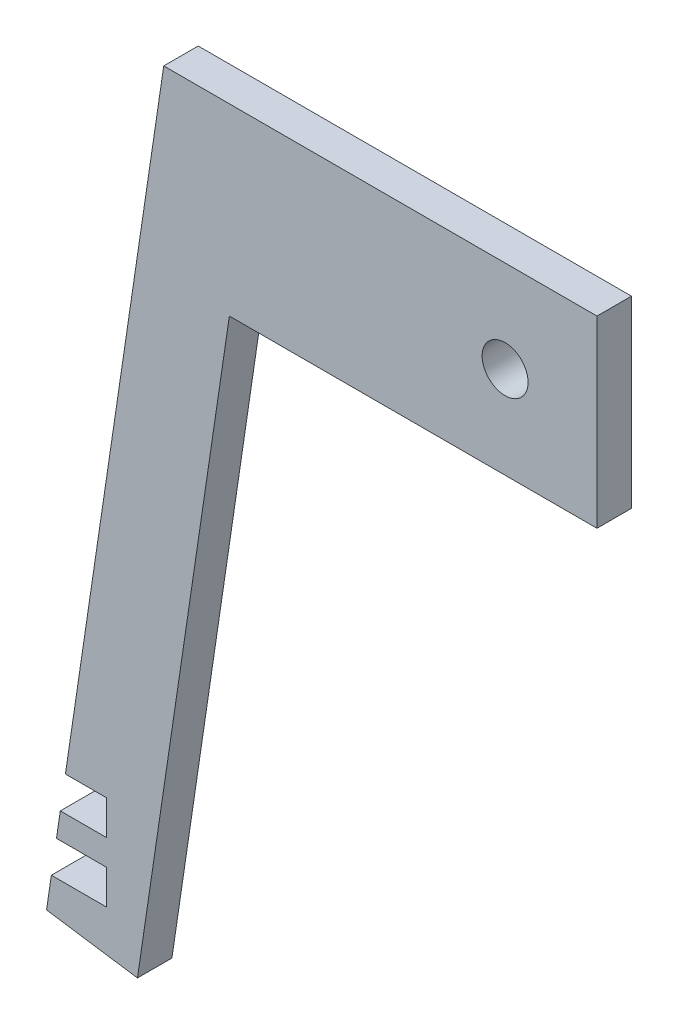
ISO-10303-21;
HEADER;
FILE_DESCRIPTION(('STEP AP214'),'2;1');
FILE_NAME('part.step','',(''),(''),'','','');
FILE_SCHEMA(('AUTOMOTIVE_DESIGN { 1 0 10303 214 1 1 1 1 }'));
ENDSEC;
DATA;
#1=APPLICATION_CONTEXT('core data for automotive mechanical design processes');
#2=APPLICATION_PROTOCOL_DEFINITION('international standard','automotive_design',2000,#1);
#3=PRODUCT_CONTEXT('',#1,'mechanical');
#4=PRODUCT('Part','Part','',(#3));
#5=PRODUCT_RELATED_PRODUCT_CATEGORY('part','',(#4));
#6=PRODUCT_DEFINITION_FORMATION('','',#4);
#7=PRODUCT_DEFINITION_CONTEXT('part definition',#1,'design');
#8=PRODUCT_DEFINITION('design','',#6,#7);
#9=PRODUCT_DEFINITION_SHAPE('','',#8);
#10=(LENGTH_UNIT() NAMED_UNIT(*) SI_UNIT(.MILLI.,.METRE.));
#11=(NAMED_UNIT(*) PLANE_ANGLE_UNIT() SI_UNIT($,.RADIAN.));
#12=(NAMED_UNIT(*) SI_UNIT($,.STERADIAN.) SOLID_ANGLE_UNIT());
#13=UNCERTAINTY_MEASURE_WITH_UNIT(LENGTH_MEASURE(1.E-05),#10,'distance_accuracy_value','');
#14=(GEOMETRIC_REPRESENTATION_CONTEXT(3) GLOBAL_UNCERTAINTY_ASSIGNED_CONTEXT((#13)) GLOBAL_UNIT_ASSIGNED_CONTEXT((#10,
#11,#12)) REPRESENTATION_CONTEXT('',''));
#15=CARTESIAN_POINT('',(0.,0.,0.));
#16=DIRECTION('',(0.,0.,1.));
#17=DIRECTION('',(1.,0.,0.));
#18=AXIS2_PLACEMENT_3D('',#15,#16,#17);
#19=CARTESIAN_POINT('',(-4.31199405295787,0.,4.7625));
#20=DIRECTION('',(-1.,0.,0.));
#21=DIRECTION('',(0.,0.,1.));
#22=AXIS2_PLACEMENT_3D('',#19,#20,#21);
#23=PLANE('',#22);
#24=DIRECTION('',(0.,1.,0.));
#25=VECTOR('',#24,1.);
#26=CARTESIAN_POINT('',(-4.31199405295787,0.,0.));
#27=LINE('',#26,#25);
#28=CARTESIAN_POINT('',(-4.31199405295787,6.35,0.));
#29=VERTEX_POINT('',#28);
#30=CARTESIAN_POINT('',(-4.31199405295787,11.1125,0.));
#31=VERTEX_POINT('',#30);
#32=EDGE_CURVE('E250',#29,#31,#27,.T.);
#33=ORIENTED_EDGE('',*,*,#32,.F.);
#34=DIRECTION('',(0.,0.,-1.));
#35=VECTOR('',#34,1.);
#36=CARTESIAN_POINT('',(-4.31199405295787,6.35,4.7625));
#37=LINE('',#36,#35);
#38=CARTESIAN_POINT('',(-4.31199405295787,6.35,4.7625));
#39=VERTEX_POINT('',#38);
#40=EDGE_CURVE('E11',#39,#29,#37,.T.);
#41=ORIENTED_EDGE('',*,*,#40,.F.);
#42=DIRECTION('',(0.,1.,0.));
#43=VECTOR('',#42,1.);
#44=CARTESIAN_POINT('',(-4.31199405295787,0.,4.7625));
#45=LINE('',#44,#43);
#46=CARTESIAN_POINT('',(-4.31199405295787,11.1125,4.7625));
#47=VERTEX_POINT('',#46);
#48=EDGE_CURVE('E188',#39,#47,#45,.T.);
#49=ORIENTED_EDGE('',*,*,#48,.T.);
#50=DIRECTION('',(0.,0.,-1.));
#51=VECTOR('',#50,1.);
#52=CARTESIAN_POINT('',(-4.31199405295787,11.1125,4.7625));
#53=LINE('',#52,#51);
#54=EDGE_CURVE('E111',#47,#31,#53,.T.);
#55=ORIENTED_EDGE('',*,*,#54,.T.);
#56=EDGE_LOOP('',(#33,#41,#49,#55));
#57=FACE_BOUND('',#56,.T.);
#58=ADVANCED_FACE('F41',(#57),#23,.T.);
#59=CARTESIAN_POINT('',(0.,6.35,4.7625));
#60=DIRECTION('',(0.,-1.,0.));
#61=DIRECTION('',(1.,0.,0.));
#62=AXIS2_PLACEMENT_3D('',#59,#60,#61);
#63=PLANE('',#62);
#64=DIRECTION('',(-1.,0.,0.));
#65=VECTOR('',#64,1.);
#66=CARTESIAN_POINT('',(0.,6.35,0.));
#67=LINE('',#66,#65);
#68=CARTESIAN_POINT('',(-11.8966428167335,6.35,0.));
#69=VERTEX_POINT('',#68);
#70=EDGE_CURVE('E246',#29,#69,#67,.T.);
#71=ORIENTED_EDGE('',*,*,#70,.T.);
#72=DIRECTION('',(0.,0.,-1.));
#73=VECTOR('',#72,1.);
#74=CARTESIAN_POINT('',(-11.8966428167335,6.35,4.7625));
#75=LINE('',#74,#73);
#76=CARTESIAN_POINT('',(-11.8966428167335,6.35,4.7625));
#77=VERTEX_POINT('',#76);
#78=EDGE_CURVE('E51',#77,#69,#75,.T.);
#79=ORIENTED_EDGE('',*,*,#78,.F.);
#80=DIRECTION('',(-1.,0.,0.));
#81=VECTOR('',#80,1.);
#82=CARTESIAN_POINT('',(0.,6.35,4.7625));
#83=LINE('',#82,#81);
#84=EDGE_CURVE('E181',#39,#77,#83,.T.);
#85=ORIENTED_EDGE('',*,*,#84,.F.);
#86=ORIENTED_EDGE('',*,*,#40,.T.);
#87=EDGE_LOOP('',(#71,#79,#85,#86));
#88=FACE_BOUND('',#87,.T.);
#89=ADVANCED_FACE('F247',(#88),#63,.F.);
#90=CARTESIAN_POINT('',(-12.5623847243805,1.86453480435538,4.7625));
#91=DIRECTION('',(-0.98916415152602,0.14681376412247,0.));
#92=DIRECTION('',(-0.14681376412247,-0.98916415152602,0.));
#93=AXIS2_PLACEMENT_3D('',#90,#91,#92);
#94=PLANE('',#93);
#95=DIRECTION('',(0.146813764122471,0.98916415152602,0.));
#96=VECTOR('',#95,1.);
#97=CARTESIAN_POINT('',(-12.5623847243805,1.86453480435538,0.));
#98=LINE('',#97,#96);
#99=CARTESIAN_POINT('',(-12.5623847243805,1.86453480435537,0.));
#100=VERTEX_POINT('',#99);
#101=EDGE_CURVE('E205',#100,#69,#98,.T.);
#102=ORIENTED_EDGE('',*,*,#101,.F.);
#103=DIRECTION('',(0.,0.,-1.));
#104=VECTOR('',#103,1.);
#105=CARTESIAN_POINT('',(-12.5623847243805,1.86453480435537,4.7625));
#106=LINE('',#105,#104);
#107=CARTESIAN_POINT('',(-12.5623847243805,1.86453480435537,4.7625));
#108=VERTEX_POINT('',#107);
#109=EDGE_CURVE('E236',#108,#100,#106,.T.);
#110=ORIENTED_EDGE('',*,*,#109,.F.);
#111=DIRECTION('',(0.146813764122471,0.98916415152602,0.));
#112=VECTOR('',#111,1.);
#113=CARTESIAN_POINT('',(-12.5623847243805,1.86453480435538,4.7625));
#114=LINE('',#113,#112);
#115=EDGE_CURVE('E173',#108,#77,#114,.T.);
#116=ORIENTED_EDGE('',*,*,#115,.T.);
#117=ORIENTED_EDGE('',*,*,#78,.T.);
#118=EDGE_LOOP('',(#102,#110,#116,#117));
#119=FACE_BOUND('',#118,.T.);
#120=ADVANCED_FACE('F241',(#119),#94,.T.);
#121=CARTESIAN_POINT('',(0.,0.,4.7625));
#122=DIRECTION('',(-0.14681376412247,-0.98916415152602,0.));
#123=DIRECTION('',(0.98916415152602,-0.14681376412247,0.));
#124=AXIS2_PLACEMENT_3D('',#121,#122,#123);
#125=PLANE('',#124);
#126=DIRECTION('',(-0.98916415152602,0.14681376412247,0.));
#127=VECTOR('',#126,1.);
#128=CARTESIAN_POINT('',(0.,0.,0.));
#129=LINE('',#128,#127);
#130=CARTESIAN_POINT('',(0.,0.,0.));
#131=VERTEX_POINT('',#130);
#132=EDGE_CURVE('E255',#131,#100,#129,.T.);
#133=ORIENTED_EDGE('',*,*,#132,.F.);
#134=DIRECTION('',(0.,0.,-1.));
#135=VECTOR('',#134,1.);
#136=CARTESIAN_POINT('',(0.,0.,4.7625));
#137=LINE('',#136,#135);
#138=CARTESIAN_POINT('',(0.,0.,4.7625));
#139=VERTEX_POINT('',#138);
#140=EDGE_CURVE('E233',#139,#131,#137,.T.);
#141=ORIENTED_EDGE('',*,*,#140,.F.);
#142=DIRECTION('',(-0.98916415152602,0.14681376412247,0.));
#143=VECTOR('',#142,1.);
#144=CARTESIAN_POINT('',(0.,0.,4.7625));
#145=LINE('',#144,#143);
#146=EDGE_CURVE('E180',#139,#108,#145,.T.);
#147=ORIENTED_EDGE('',*,*,#146,.T.);
#148=ORIENTED_EDGE('',*,*,#109,.T.);
#149=EDGE_LOOP('',(#133,#141,#147,#148));
#150=FACE_BOUND('',#149,.T.);
#151=ADVANCED_FACE('F321',(#150),#125,.T.);
#152=CARTESIAN_POINT('',(0.,0.,4.7625));
#153=DIRECTION('',(-0.98916415152602,0.14681376412247,0.));
#154=DIRECTION('',(-0.14681376412247,-0.98916415152602,0.));
#155=AXIS2_PLACEMENT_3D('',#152,#153,#154);
#156=PLANE('',#155);
#157=DIRECTION('',(0.146813764122471,0.98916415152602,0.));
#158=VECTOR('',#157,1.);
#159=CARTESIAN_POINT('',(0.,0.,0.));
#160=LINE('',#159,#158);
#161=CARTESIAN_POINT('',(12.7,85.5668049890815,0.));
#162=VERTEX_POINT('',#161);
#163=EDGE_CURVE('E258',#131,#162,#160,.T.);
#164=ORIENTED_EDGE('',*,*,#163,.T.);
#165=DIRECTION('',(0.,0.,-1.));
#166=VECTOR('',#165,1.);
#167=CARTESIAN_POINT('',(12.7,85.5668049890815,4.7625));
#168=LINE('',#167,#166);
#169=CARTESIAN_POINT('',(12.7,85.5668049890815,4.7625));
#170=VERTEX_POINT('',#169);
#171=EDGE_CURVE('E230',#170,#162,#168,.T.);
#172=ORIENTED_EDGE('',*,*,#171,.F.);
#173=DIRECTION('',(0.146813764122471,0.98916415152602,0.));
#174=VECTOR('',#173,1.);
#175=CARTESIAN_POINT('',(0.,0.,4.7625));
#176=LINE('',#175,#174);
#177=EDGE_CURVE('E187',#139,#170,#176,.T.);
#178=ORIENTED_EDGE('',*,*,#177,.F.);
#179=ORIENTED_EDGE('',*,*,#140,.T.);
#180=EDGE_LOOP('',(#164,#172,#178,#179));
#181=FACE_BOUND('',#180,.T.);
#182=ADVANCED_FACE('F327',(#181),#156,.F.);
#183=CARTESIAN_POINT('',(0.,85.5668049890815,4.7625));
#184=DIRECTION('',(0.,-1.,0.));
#185=DIRECTION('',(0.,0.,-1.));
#186=AXIS2_PLACEMENT_3D('',#183,#184,#185);
#187=PLANE('',#186);
#188=DIRECTION('',(-1.,0.,0.));
#189=VECTOR('',#188,1.);
#190=CARTESIAN_POINT('',(0.,85.5668049890815,0.));
#191=LINE('',#190,#189);
#192=CARTESIAN_POINT('',(63.5,85.5668049890815,0.));
#193=VERTEX_POINT('',#192);
#194=EDGE_CURVE('E265',#193,#162,#191,.T.);
#195=ORIENTED_EDGE('',*,*,#194,.F.);
#196=DIRECTION('',(0.,0.,-1.));
#197=VECTOR('',#196,1.);
#198=CARTESIAN_POINT('',(63.5,85.5668049890815,4.7625));
#199=LINE('',#198,#197);
#200=CARTESIAN_POINT('',(63.5,85.5668049890815,4.7625));
#201=VERTEX_POINT('',#200);
#202=EDGE_CURVE('E227',#201,#193,#199,.T.);
#203=ORIENTED_EDGE('',*,*,#202,.F.);
#204=DIRECTION('',(-1.,0.,0.));
#205=VECTOR('',#204,1.);
#206=CARTESIAN_POINT('',(0.,85.5668049890815,4.7625));
#207=LINE('',#206,#205);
#208=EDGE_CURVE('E324',#201,#170,#207,.T.);
#209=ORIENTED_EDGE('',*,*,#208,.T.);
#210=ORIENTED_EDGE('',*,*,#171,.T.);
#211=EDGE_LOOP('',(#195,#203,#209,#210));
#212=FACE_BOUND('',#211,.T.);
#213=ADVANCED_FACE('F317',(#212),#187,.T.);
#214=CARTESIAN_POINT('',(63.5,0.,4.7625));
#215=DIRECTION('',(1.,0.,0.));
#216=DIRECTION('',(0.,0.,-1.));
#217=AXIS2_PLACEMENT_3D('',#214,#215,#216);
#218=PLANE('',#217);
#219=DIRECTION('',(0.,-1.,0.));
#220=VECTOR('',#219,1.);
#221=CARTESIAN_POINT('',(63.5,0.,0.));
#222=LINE('',#221,#220);
#223=CARTESIAN_POINT('',(63.5,110.966804989082,0.));
#224=VERTEX_POINT('',#223);
#225=EDGE_CURVE('E269',#224,#193,#222,.T.);
#226=ORIENTED_EDGE('',*,*,#225,.F.);
#227=DIRECTION('',(0.,0.,-1.));
#228=VECTOR('',#227,1.);
#229=CARTESIAN_POINT('',(63.5,110.966804989082,4.7625));
#230=LINE('',#229,#228);
#231=CARTESIAN_POINT('',(63.5,110.966804989082,4.7625));
#232=VERTEX_POINT('',#231);
#233=EDGE_CURVE('E224',#232,#224,#230,.T.);
#234=ORIENTED_EDGE('',*,*,#233,.F.);
#235=DIRECTION('',(0.,-1.,0.));
#236=VECTOR('',#235,1.);
#237=CARTESIAN_POINT('',(63.5,0.,4.7625));
#238=LINE('',#237,#236);
#239=EDGE_CURVE('E313',#232,#201,#238,.T.);
#240=ORIENTED_EDGE('',*,*,#239,.T.);
#241=ORIENTED_EDGE('',*,*,#202,.T.);
#242=EDGE_LOOP('',(#226,#234,#240,#241));
#243=FACE_BOUND('',#242,.T.);
#244=ADVANCED_FACE('F311',(#243),#218,.T.);
#245=CARTESIAN_POINT('',(0.,110.966804989082,4.7625));
#246=DIRECTION('',(0.,1.,0.));
#247=DIRECTION('',(0.,0.,1.));
#248=AXIS2_PLACEMENT_3D('',#245,#246,#247);
#249=PLANE('',#248);
#250=DIRECTION('',(1.,0.,0.));
#251=VECTOR('',#250,1.);
#252=CARTESIAN_POINT('',(0.,110.966804989082,0.));
#253=LINE('',#252,#251);
#254=CARTESIAN_POINT('',(3.63079710030992,110.966804989082,0.));
#255=VERTEX_POINT('',#254);
#256=EDGE_CURVE('E273',#255,#224,#253,.T.);
#257=ORIENTED_EDGE('',*,*,#256,.F.);
#258=DIRECTION('',(0.,0.,-1.));
#259=VECTOR('',#258,1.);
#260=CARTESIAN_POINT('',(3.63079710030992,110.966804989082,4.7625));
#261=LINE('',#260,#259);
#262=CARTESIAN_POINT('',(3.63079710030992,110.966804989082,4.7625));
#263=VERTEX_POINT('',#262);
#264=EDGE_CURVE('E221',#263,#255,#261,.T.);
#265=ORIENTED_EDGE('',*,*,#264,.F.);
#266=DIRECTION('',(1.,0.,0.));
#267=VECTOR('',#266,1.);
#268=CARTESIAN_POINT('',(0.,110.966804989082,4.7625));
#269=LINE('',#268,#267);
#270=EDGE_CURVE('E307',#263,#232,#269,.T.);
#271=ORIENTED_EDGE('',*,*,#270,.T.);
#272=ORIENTED_EDGE('',*,*,#233,.T.);
#273=EDGE_LOOP('',(#257,#265,#271,#272));
#274=FACE_BOUND('',#273,.T.);
#275=ADVANCED_FACE('F304',(#274),#249,.T.);
#276=CARTESIAN_POINT('',(-12.5623847243805,1.86453480435538,4.7625));
#277=DIRECTION('',(-0.98916415152602,0.14681376412247,0.));
#278=DIRECTION('',(-0.14681376412247,-0.98916415152602,0.));
#279=AXIS2_PLACEMENT_3D('',#276,#277,#278);
#280=PLANE('',#279);
#281=DIRECTION('',(0.146813764122471,0.98916415152602,0.));
#282=VECTOR('',#281,1.);
#283=CARTESIAN_POINT('',(-12.5623847243805,1.86453480435538,0.));
#284=LINE('',#283,#282);
#285=CARTESIAN_POINT('',(-9.95513407369701,19.431,0.));
#286=VERTEX_POINT('',#285);
#287=EDGE_CURVE('E277',#286,#255,#284,.T.);
#288=ORIENTED_EDGE('',*,*,#287,.F.);
#289=DIRECTION('',(0.,0.,-1.));
#290=VECTOR('',#289,1.);
#291=CARTESIAN_POINT('',(-9.95513407369701,19.431,4.7625));
#292=LINE('',#291,#290);
#293=CARTESIAN_POINT('',(-9.95513407369701,19.431,4.7625));
#294=VERTEX_POINT('',#293);
#295=EDGE_CURVE('E218',#294,#286,#292,.T.);
#296=ORIENTED_EDGE('',*,*,#295,.F.);
#297=DIRECTION('',(0.146813764122471,0.98916415152602,0.));
#298=VECTOR('',#297,1.);
#299=CARTESIAN_POINT('',(-12.5623847243805,1.86453480435538,4.7625));
#300=LINE('',#299,#298);
#301=EDGE_CURVE('E335',#294,#263,#300,.T.);
#302=ORIENTED_EDGE('',*,*,#301,.T.);
#303=ORIENTED_EDGE('',*,*,#264,.T.);
#304=EDGE_LOOP('',(#288,#296,#302,#303));
#305=FACE_BOUND('',#304,.T.);
#306=ADVANCED_FACE('F300',(#305),#280,.T.);
#307=CARTESIAN_POINT('',(0.,19.431,4.7625));
#308=DIRECTION('',(0.,-1.,0.));
#309=DIRECTION('',(1.,0.,0.));
#310=AXIS2_PLACEMENT_3D('',#307,#308,#309);
#311=PLANE('',#310);
#312=DIRECTION('',(-1.,0.,0.));
#313=VECTOR('',#312,1.);
#314=CARTESIAN_POINT('',(0.,19.431,0.));
#315=LINE('',#314,#313);
#316=CARTESIAN_POINT('',(-4.31199405295787,19.431,0.));
#317=VERTEX_POINT('',#316);
#318=EDGE_CURVE('E281',#317,#286,#315,.T.);
#319=ORIENTED_EDGE('',*,*,#318,.F.);
#320=DIRECTION('',(0.,0.,-1.));
#321=VECTOR('',#320,1.);
#322=CARTESIAN_POINT('',(-4.31199405295787,19.431,4.7625));
#323=LINE('',#322,#321);
#324=CARTESIAN_POINT('',(-4.31199405295787,19.431,4.7625));
#325=VERTEX_POINT('',#324);
#326=EDGE_CURVE('E215',#325,#317,#323,.T.);
#327=ORIENTED_EDGE('',*,*,#326,.F.);
#328=DIRECTION('',(-1.,0.,0.));
#329=VECTOR('',#328,1.);
#330=CARTESIAN_POINT('',(0.,19.431,4.7625));
#331=LINE('',#330,#329);
#332=EDGE_CURVE('E296',#325,#294,#331,.T.);
#333=ORIENTED_EDGE('',*,*,#332,.T.);
#334=ORIENTED_EDGE('',*,*,#295,.T.);
#335=EDGE_LOOP('',(#319,#327,#333,#334));
#336=FACE_BOUND('',#335,.T.);
#337=ADVANCED_FACE('F294',(#336),#311,.T.);
#338=CARTESIAN_POINT('',(-4.31199405295787,0.,4.7625));
#339=DIRECTION('',(-1.,0.,0.));
#340=DIRECTION('',(0.,0.,1.));
#341=AXIS2_PLACEMENT_3D('',#338,#339,#340);
#342=PLANE('',#341);
#343=DIRECTION('',(0.,1.,0.));
#344=VECTOR('',#343,1.);
#345=CARTESIAN_POINT('',(-4.31199405295787,0.,0.));
#346=LINE('',#345,#344);
#347=CARTESIAN_POINT('',(-4.31199405295787,14.6685,0.));
#348=VERTEX_POINT('',#347);
#349=EDGE_CURVE('E284',#348,#317,#346,.T.);
#350=ORIENTED_EDGE('',*,*,#349,.F.);
#351=DIRECTION('',(0.,0.,-1.));
#352=VECTOR('',#351,1.);
#353=CARTESIAN_POINT('',(-4.31199405295787,14.6685,4.7625));
#354=LINE('',#353,#352);
#355=CARTESIAN_POINT('',(-4.31199405295787,14.6685,4.7625));
#356=VERTEX_POINT('',#355);
#357=EDGE_CURVE('E168',#356,#348,#354,.T.);
#358=ORIENTED_EDGE('',*,*,#357,.F.);
#359=DIRECTION('',(0.,1.,0.));
#360=VECTOR('',#359,1.);
#361=CARTESIAN_POINT('',(-4.31199405295787,0.,4.7625));
#362=LINE('',#361,#360);
#363=EDGE_CURVE('E155',#356,#325,#362,.T.);
#364=ORIENTED_EDGE('',*,*,#363,.T.);
#365=ORIENTED_EDGE('',*,*,#326,.T.);
#366=EDGE_LOOP('',(#350,#358,#364,#365));
#367=FACE_BOUND('',#366,.T.);
#368=ADVANCED_FACE('F291',(#367),#342,.T.);
#369=CARTESIAN_POINT('',(0.,14.6685,4.7625));
#370=DIRECTION('',(0.,-1.,0.));
#371=DIRECTION('',(0.,0.,-1.));
#372=AXIS2_PLACEMENT_3D('',#369,#370,#371);
#373=PLANE('',#372);
#374=DIRECTION('',(-1.,0.,0.));
#375=VECTOR('',#374,1.);
#376=CARTESIAN_POINT('',(0.,14.6685,0.));
#377=LINE('',#376,#375);
#378=CARTESIAN_POINT('',(-10.6619940529579,14.6685,0.));
#379=VERTEX_POINT('',#378);
#380=EDGE_CURVE('E163',#348,#379,#377,.T.);
#381=ORIENTED_EDGE('',*,*,#380,.T.);
#382=DIRECTION('',(0.,0.,-1.));
#383=VECTOR('',#382,1.);
#384=CARTESIAN_POINT('',(-10.6619940529579,14.6685,4.7625));
#385=LINE('',#384,#383);
#386=CARTESIAN_POINT('',(-10.6619940529579,14.6685,4.7625));
#387=VERTEX_POINT('',#386);
#388=EDGE_CURVE('E160',#387,#379,#385,.T.);
#389=ORIENTED_EDGE('',*,*,#388,.F.);
#390=DIRECTION('',(-1.,0.,0.));
#391=VECTOR('',#390,1.);
#392=CARTESIAN_POINT('',(0.,14.6685,4.7625));
#393=LINE('',#392,#391);
#394=EDGE_CURVE('E148',#356,#387,#393,.T.);
#395=ORIENTED_EDGE('',*,*,#394,.F.);
#396=ORIENTED_EDGE('',*,*,#357,.T.);
#397=EDGE_LOOP('',(#381,#389,#395,#396));
#398=FACE_BOUND('',#397,.T.);
#399=ADVANCED_FACE('F161',(#398),#373,.F.);
#400=CARTESIAN_POINT('',(-11.1897828374726,11.1125,0.));
#401=VERTEX_POINT('',#400);
#402=EDGE_CURVE('E200',#401,#379,#98,.T.);
#403=ORIENTED_EDGE('',*,*,#402,.F.);
#404=DIRECTION('',(0.,0.,-1.));
#405=VECTOR('',#404,1.);
#406=CARTESIAN_POINT('',(-11.1897828374726,11.1125,4.7625));
#407=LINE('',#406,#405);
#408=CARTESIAN_POINT('',(-11.1897828374726,11.1125,4.7625));
#409=VERTEX_POINT('',#408);
#410=EDGE_CURVE('E104',#409,#401,#407,.T.);
#411=ORIENTED_EDGE('',*,*,#410,.F.);
#412=EDGE_CURVE('E152',#409,#387,#114,.T.);
#413=ORIENTED_EDGE('',*,*,#412,.T.);
#414=ORIENTED_EDGE('',*,*,#388,.T.);
#415=EDGE_LOOP('',(#403,#411,#413,#414));
#416=FACE_BOUND('',#415,.T.);
#417=ADVANCED_FACE('F170',(#416),#94,.T.);
#418=CARTESIAN_POINT('',(50.8,98.2668049890815,4.7625));
#419=DIRECTION('',(0.,0.,-1.));
#420=DIRECTION('',(-1.,0.,0.));
#421=AXIS2_PLACEMENT_3D('',#418,#419,#420);
#422=CYLINDRICAL_SURFACE('',#421,3.175);
#423=CARTESIAN_POINT('',(50.8,98.2668049890815,4.7625));
#424=DIRECTION('',(0.,0.,1.));
#425=DIRECTION('',(1.,0.,0.));
#426=AXIS2_PLACEMENT_3D('',#423,#424,#425);
#427=CIRCLE('',#426,3.175);
#428=CARTESIAN_POINT('',(53.975,98.2668049890815,4.7625));
#429=VERTEX_POINT('',#428);
#430=EDGE_CURVE('E191',#429,#429,#427,.T.);
#431=ORIENTED_EDGE('',*,*,#430,.T.);
#432=EDGE_LOOP('',(#431));
#433=FACE_BOUND('',#432,.T.);
#434=CARTESIAN_POINT('',(50.8,98.2668049890815,0.));
#435=DIRECTION('',(0.,0.,1.));
#436=DIRECTION('',(1.,0.,0.));
#437=AXIS2_PLACEMENT_3D('',#434,#435,#436);
#438=CIRCLE('',#437,3.175);
#439=CARTESIAN_POINT('',(53.975,98.2668049890815,0.));
#440=VERTEX_POINT('',#439);
#441=EDGE_CURVE('E342',#440,#440,#438,.T.);
#442=ORIENTED_EDGE('',*,*,#441,.F.);
#443=EDGE_LOOP('',(#442));
#444=FACE_BOUND('',#443,.T.);
#445=ADVANCED_FACE('F43',(#433,#444),#422,.F.);
#446=CARTESIAN_POINT('',(0.,11.1125,4.7625));
#447=DIRECTION('',(0.,1.,0.));
#448=DIRECTION('',(0.,0.,1.));
#449=AXIS2_PLACEMENT_3D('',#446,#447,#448);
#450=PLANE('',#449);
#451=DIRECTION('',(1.,0.,0.));
#452=VECTOR('',#451,1.);
#453=CARTESIAN_POINT('',(0.,11.1125,0.));
#454=LINE('',#453,#452);
#455=EDGE_CURVE('E196',#401,#31,#454,.T.);
#456=ORIENTED_EDGE('',*,*,#455,.T.);
#457=ORIENTED_EDGE('',*,*,#54,.F.);
#458=DIRECTION('',(1.,0.,0.));
#459=VECTOR('',#458,1.);
#460=CARTESIAN_POINT('',(0.,11.1125,4.7625));
#461=LINE('',#460,#459);
#462=EDGE_CURVE('E59',#409,#47,#461,.T.);
#463=ORIENTED_EDGE('',*,*,#462,.F.);
#464=ORIENTED_EDGE('',*,*,#410,.T.);
#465=EDGE_LOOP('',(#456,#457,#463,#464));
#466=FACE_BOUND('',#465,.T.);
#467=ADVANCED_FACE('F372',(#466),#450,.F.);
#468=CARTESIAN_POINT('',(0.,0.,4.7625));
#469=DIRECTION('',(0.,0.,1.));
#470=DIRECTION('',(1.,0.,0.));
#471=AXIS2_PLACEMENT_3D('',#468,#469,#470);
#472=PLANE('',#471);
#473=ORIENTED_EDGE('',*,*,#430,.F.);
#474=EDGE_LOOP('',(#473));
#475=FACE_BOUND('',#474,.T.);
#476=ORIENTED_EDGE('',*,*,#48,.F.);
#477=ORIENTED_EDGE('',*,*,#84,.T.);
#478=ORIENTED_EDGE('',*,*,#115,.F.);
#479=ORIENTED_EDGE('',*,*,#146,.F.);
#480=ORIENTED_EDGE('',*,*,#177,.T.);
#481=ORIENTED_EDGE('',*,*,#208,.F.);
#482=ORIENTED_EDGE('',*,*,#239,.F.);
#483=ORIENTED_EDGE('',*,*,#270,.F.);
#484=ORIENTED_EDGE('',*,*,#301,.F.);
#485=ORIENTED_EDGE('',*,*,#332,.F.);
#486=ORIENTED_EDGE('',*,*,#363,.F.);
#487=ORIENTED_EDGE('',*,*,#394,.T.);
#488=ORIENTED_EDGE('',*,*,#412,.F.);
#489=ORIENTED_EDGE('',*,*,#462,.T.);
#490=EDGE_LOOP('',(#476,#477,#478,#479,#480,#481,#482,#483,#484,#485,#486,#487,#488,#489));
#491=FACE_BOUND('',#490,.T.);
#492=ADVANCED_FACE('F150',(#475,#491),#472,.T.);
#493=CARTESIAN_POINT('',(0.,0.,0.));
#494=DIRECTION('',(0.,0.,1.));
#495=DIRECTION('',(1.,0.,0.));
#496=AXIS2_PLACEMENT_3D('',#493,#494,#495);
#497=PLANE('',#496);
#498=ORIENTED_EDGE('',*,*,#441,.T.);
#499=EDGE_LOOP('',(#498));
#500=FACE_BOUND('',#499,.T.);
#501=ORIENTED_EDGE('',*,*,#32,.T.);
#502=ORIENTED_EDGE('',*,*,#455,.F.);
#503=ORIENTED_EDGE('',*,*,#402,.T.);
#504=ORIENTED_EDGE('',*,*,#380,.F.);
#505=ORIENTED_EDGE('',*,*,#349,.T.);
#506=ORIENTED_EDGE('',*,*,#318,.T.);
#507=ORIENTED_EDGE('',*,*,#287,.T.);
#508=ORIENTED_EDGE('',*,*,#256,.T.);
#509=ORIENTED_EDGE('',*,*,#225,.T.);
#510=ORIENTED_EDGE('',*,*,#194,.T.);
#511=ORIENTED_EDGE('',*,*,#163,.F.);
#512=ORIENTED_EDGE('',*,*,#132,.T.);
#513=ORIENTED_EDGE('',*,*,#101,.T.);
#514=ORIENTED_EDGE('',*,*,#70,.F.);
#515=EDGE_LOOP('',(#501,#502,#503,#504,#505,#506,#507,#508,#509,#510,#511,#512,#513,#514));
#516=FACE_BOUND('',#515,.T.);
#517=ADVANCED_FACE('F252',(#500,#516),#497,.F.);
#518=CLOSED_SHELL('',(#58,#89,#120,#151,#182,#213,#244,#275,#306,#337,#368,#399,#417,#445,#467,
#492,#517));
#519=MANIFOLD_SOLID_BREP('B2',#518);
#520=ADVANCED_BREP_SHAPE_REPRESENTATION('',(#18,#519),#14);
#521=SHAPE_DEFINITION_REPRESENTATION(#9,#520);
ENDSEC;
END-ISO-10303-21;
